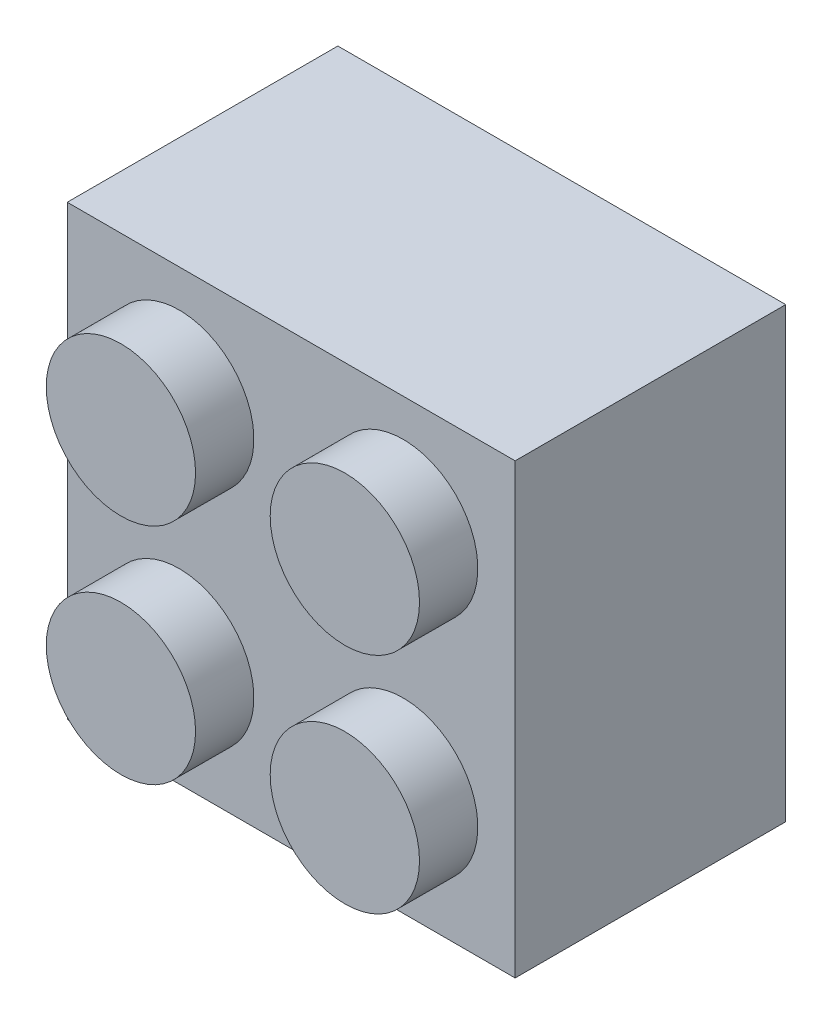
ISO-10303-21;
HEADER;
FILE_DESCRIPTION(('STEP AP214'),'2;1');
FILE_NAME('part.step','',(''),(''),'','','');
FILE_SCHEMA(('AUTOMOTIVE_DESIGN { 1 0 10303 214 1 1 1 1 }'));
ENDSEC;
DATA;
#1=APPLICATION_CONTEXT('core data for automotive mechanical design processes');
#2=APPLICATION_PROTOCOL_DEFINITION('international standard','automotive_design',2000,#1);
#3=PRODUCT_CONTEXT('',#1,'mechanical');
#4=PRODUCT('Part','Part','',(#3));
#5=PRODUCT_RELATED_PRODUCT_CATEGORY('part','',(#4));
#6=PRODUCT_DEFINITION_FORMATION('','',#4);
#7=PRODUCT_DEFINITION_CONTEXT('part definition',#1,'design');
#8=PRODUCT_DEFINITION('design','',#6,#7);
#9=PRODUCT_DEFINITION_SHAPE('','',#8);
#10=(LENGTH_UNIT() NAMED_UNIT(*) SI_UNIT(.MILLI.,.METRE.));
#11=(NAMED_UNIT(*) PLANE_ANGLE_UNIT() SI_UNIT($,.RADIAN.));
#12=(NAMED_UNIT(*) SI_UNIT($,.STERADIAN.) SOLID_ANGLE_UNIT());
#13=UNCERTAINTY_MEASURE_WITH_UNIT(LENGTH_MEASURE(1.E-05),#10,'distance_accuracy_value','');
#14=(GEOMETRIC_REPRESENTATION_CONTEXT(3) GLOBAL_UNCERTAINTY_ASSIGNED_CONTEXT((#13)) GLOBAL_UNIT_ASSIGNED_CONTEXT((#10,
#11,#12)) REPRESENTATION_CONTEXT('',''));
#15=CARTESIAN_POINT('',(0.,0.,0.));
#16=DIRECTION('',(0.,0.,1.));
#17=DIRECTION('',(1.,0.,0.));
#18=AXIS2_PLACEMENT_3D('',#15,#16,#17);
#19=CARTESIAN_POINT('',(0.,0.,0.));
#20=DIRECTION('',(0.,0.,-1.));
#21=DIRECTION('',(-1.,0.,0.));
#22=AXIS2_PLACEMENT_3D('',#19,#20,#21);
#23=PLANE('',#22);
#24=DIRECTION('',(0.,-1.,0.));
#25=VECTOR('',#24,1.);
#26=CARTESIAN_POINT('',(-48.,-48.,0.));
#27=LINE('',#26,#25);
#28=CARTESIAN_POINT('',(-48.,48.,0.));
#29=VERTEX_POINT('',#28);
#30=CARTESIAN_POINT('',(-48.,-48.,0.));
#31=VERTEX_POINT('',#30);
#32=EDGE_CURVE('E188',#29,#31,#27,.T.);
#33=ORIENTED_EDGE('',*,*,#32,.F.);
#34=DIRECTION('',(-1.,0.,0.));
#35=VECTOR('',#34,1.);
#36=CARTESIAN_POINT('',(-48.,48.,0.));
#37=LINE('',#36,#35);
#38=CARTESIAN_POINT('',(48.,48.,0.));
#39=VERTEX_POINT('',#38);
#40=EDGE_CURVE('E67',#39,#29,#37,.T.);
#41=ORIENTED_EDGE('',*,*,#40,.F.);
#42=DIRECTION('',(0.,1.,0.));
#43=VECTOR('',#42,1.);
#44=CARTESIAN_POINT('',(48.,48.,0.));
#45=LINE('',#44,#43);
#46=CARTESIAN_POINT('',(48.,-48.,0.));
#47=VERTEX_POINT('',#46);
#48=EDGE_CURVE('E117',#47,#39,#45,.T.);
#49=ORIENTED_EDGE('',*,*,#48,.F.);
#50=DIRECTION('',(1.,0.,0.));
#51=VECTOR('',#50,1.);
#52=CARTESIAN_POINT('',(48.,-48.,0.));
#53=LINE('',#52,#51);
#54=EDGE_CURVE('E192',#31,#47,#53,.T.);
#55=ORIENTED_EDGE('',*,*,#54,.F.);
#56=EDGE_LOOP('',(#33,#41,#49,#55));
#57=FACE_BOUND('',#56,.T.);
#58=DIRECTION('',(-1.,0.,0.));
#59=VECTOR('',#58,1.);
#60=CARTESIAN_POINT('',(-40.,40.,0.));
#61=LINE('',#60,#59);
#62=CARTESIAN_POINT('',(40.,40.,0.));
#63=VERTEX_POINT('',#62);
#64=CARTESIAN_POINT('',(-40.,40.,0.));
#65=VERTEX_POINT('',#64);
#66=EDGE_CURVE('E151',#63,#65,#61,.T.);
#67=ORIENTED_EDGE('',*,*,#66,.T.);
#68=DIRECTION('',(0.,-1.,0.));
#69=VECTOR('',#68,1.);
#70=CARTESIAN_POINT('',(-40.,-40.,0.));
#71=LINE('',#70,#69);
#72=CARTESIAN_POINT('',(-40.,-40.,0.));
#73=VERTEX_POINT('',#72);
#74=EDGE_CURVE('E59',#65,#73,#71,.T.);
#75=ORIENTED_EDGE('',*,*,#74,.T.);
#76=DIRECTION('',(1.,0.,0.));
#77=VECTOR('',#76,1.);
#78=CARTESIAN_POINT('',(40.,-40.,0.));
#79=LINE('',#78,#77);
#80=CARTESIAN_POINT('',(40.,-40.,0.));
#81=VERTEX_POINT('',#80);
#82=EDGE_CURVE('E166',#73,#81,#79,.T.);
#83=ORIENTED_EDGE('',*,*,#82,.T.);
#84=DIRECTION('',(0.,1.,0.));
#85=VECTOR('',#84,1.);
#86=CARTESIAN_POINT('',(40.,40.,0.));
#87=LINE('',#86,#85);
#88=EDGE_CURVE('E170',#81,#63,#87,.T.);
#89=ORIENTED_EDGE('',*,*,#88,.T.);
#90=EDGE_LOOP('',(#67,#75,#83,#89));
#91=FACE_BOUND('',#90,.T.);
#92=ADVANCED_FACE('F43',(#57,#91),#23,.T.);
#93=CARTESIAN_POINT('',(-48.,-48.,48.));
#94=DIRECTION('',(1.,0.,0.));
#95=DIRECTION('',(0.,1.,0.));
#96=AXIS2_PLACEMENT_3D('',#93,#94,#95);
#97=PLANE('',#96);
#98=ORIENTED_EDGE('',*,*,#32,.T.);
#99=DIRECTION('',(0.,0.,-1.));
#100=VECTOR('',#99,1.);
#101=CARTESIAN_POINT('',(-48.,-48.,48.));
#102=LINE('',#101,#100);
#103=CARTESIAN_POINT('',(-48.,-48.,58.));
#104=VERTEX_POINT('',#103);
#105=EDGE_CURVE('E203',#104,#31,#102,.T.);
#106=ORIENTED_EDGE('',*,*,#105,.F.);
#107=DIRECTION('',(0.,1.,0.));
#108=VECTOR('',#107,1.);
#109=CARTESIAN_POINT('',(-48.,48.,58.));
#110=LINE('',#109,#108);
#111=CARTESIAN_POINT('',(-48.,48.,58.));
#112=VERTEX_POINT('',#111);
#113=EDGE_CURVE('E144',#104,#112,#110,.T.);
#114=ORIENTED_EDGE('',*,*,#113,.T.);
#115=DIRECTION('',(0.,0.,-1.));
#116=VECTOR('',#115,1.);
#117=CARTESIAN_POINT('',(-48.,48.,48.));
#118=LINE('',#117,#116);
#119=EDGE_CURVE('E121',#112,#29,#118,.T.);
#120=ORIENTED_EDGE('',*,*,#119,.T.);
#121=EDGE_LOOP('',(#98,#106,#114,#120));
#122=FACE_BOUND('',#121,.T.);
#123=ADVANCED_FACE('F246',(#122),#97,.F.);
#124=CARTESIAN_POINT('',(48.,-48.,48.));
#125=DIRECTION('',(0.,1.,0.));
#126=DIRECTION('',(-1.,0.,0.));
#127=AXIS2_PLACEMENT_3D('',#124,#125,#126);
#128=PLANE('',#127);
#129=ORIENTED_EDGE('',*,*,#54,.T.);
#130=DIRECTION('',(0.,0.,-1.));
#131=VECTOR('',#130,1.);
#132=CARTESIAN_POINT('',(48.,-48.,48.));
#133=LINE('',#132,#131);
#134=CARTESIAN_POINT('',(48.,-48.,58.));
#135=VERTEX_POINT('',#134);
#136=EDGE_CURVE('E120',#135,#47,#133,.T.);
#137=ORIENTED_EDGE('',*,*,#136,.F.);
#138=DIRECTION('',(-1.,0.,0.));
#139=VECTOR('',#138,1.);
#140=CARTESIAN_POINT('',(-48.,-48.,58.));
#141=LINE('',#140,#139);
#142=EDGE_CURVE('E131',#135,#104,#141,.T.);
#143=ORIENTED_EDGE('',*,*,#142,.T.);
#144=ORIENTED_EDGE('',*,*,#105,.T.);
#145=EDGE_LOOP('',(#129,#137,#143,#144));
#146=FACE_BOUND('',#145,.T.);
#147=ADVANCED_FACE('F252',(#146),#128,.F.);
#148=CARTESIAN_POINT('',(48.,48.,48.));
#149=DIRECTION('',(-1.,0.,0.));
#150=DIRECTION('',(0.,-1.,0.));
#151=AXIS2_PLACEMENT_3D('',#148,#149,#150);
#152=PLANE('',#151);
#153=ORIENTED_EDGE('',*,*,#48,.T.);
#154=DIRECTION('',(0.,0.,-1.));
#155=VECTOR('',#154,1.);
#156=CARTESIAN_POINT('',(48.,48.,48.));
#157=LINE('',#156,#155);
#158=CARTESIAN_POINT('',(48.,48.,58.));
#159=VERTEX_POINT('',#158);
#160=EDGE_CURVE('E111',#159,#39,#157,.T.);
#161=ORIENTED_EDGE('',*,*,#160,.F.);
#162=DIRECTION('',(0.,-1.,0.));
#163=VECTOR('',#162,1.);
#164=CARTESIAN_POINT('',(48.,48.,58.));
#165=LINE('',#164,#163);
#166=EDGE_CURVE('E115',#159,#135,#165,.T.);
#167=ORIENTED_EDGE('',*,*,#166,.T.);
#168=ORIENTED_EDGE('',*,*,#136,.T.);
#169=EDGE_LOOP('',(#153,#161,#167,#168));
#170=FACE_BOUND('',#169,.T.);
#171=ADVANCED_FACE('F113',(#170),#152,.F.);
#172=CARTESIAN_POINT('',(-48.,48.,48.));
#173=DIRECTION('',(0.,-1.,0.));
#174=DIRECTION('',(1.,0.,0.));
#175=AXIS2_PLACEMENT_3D('',#172,#173,#174);
#176=PLANE('',#175);
#177=ORIENTED_EDGE('',*,*,#40,.T.);
#178=ORIENTED_EDGE('',*,*,#119,.F.);
#179=DIRECTION('',(1.,0.,0.));
#180=VECTOR('',#179,1.);
#181=CARTESIAN_POINT('',(-48.,48.,58.));
#182=LINE('',#181,#180);
#183=EDGE_CURVE('E128',#112,#159,#182,.T.);
#184=ORIENTED_EDGE('',*,*,#183,.T.);
#185=ORIENTED_EDGE('',*,*,#160,.T.);
#186=EDGE_LOOP('',(#177,#178,#184,#185));
#187=FACE_BOUND('',#186,.T.);
#188=ADVANCED_FACE('F134',(#187),#176,.F.);
#189=CARTESIAN_POINT('',(-40.,-40.,48.));
#190=DIRECTION('',(1.,0.,0.));
#191=DIRECTION('',(0.,0.,-1.));
#192=AXIS2_PLACEMENT_3D('',#189,#190,#191);
#193=PLANE('',#192);
#194=ORIENTED_EDGE('',*,*,#74,.F.);
#195=DIRECTION('',(0.,0.,-1.));
#196=VECTOR('',#195,1.);
#197=CARTESIAN_POINT('',(-40.,40.,48.));
#198=LINE('',#197,#196);
#199=CARTESIAN_POINT('',(-40.,40.,48.));
#200=VERTEX_POINT('',#199);
#201=EDGE_CURVE('E163',#200,#65,#198,.T.);
#202=ORIENTED_EDGE('',*,*,#201,.F.);
#203=DIRECTION('',(0.,-1.,0.));
#204=VECTOR('',#203,1.);
#205=CARTESIAN_POINT('',(-40.,-40.,48.));
#206=LINE('',#205,#204);
#207=CARTESIAN_POINT('',(-40.,-40.,48.));
#208=VERTEX_POINT('',#207);
#209=EDGE_CURVE('E146',#200,#208,#206,.T.);
#210=ORIENTED_EDGE('',*,*,#209,.T.);
#211=DIRECTION('',(0.,0.,-1.));
#212=VECTOR('',#211,1.);
#213=CARTESIAN_POINT('',(-40.,-40.,48.));
#214=LINE('',#213,#212);
#215=EDGE_CURVE('E185',#208,#73,#214,.T.);
#216=ORIENTED_EDGE('',*,*,#215,.T.);
#217=EDGE_LOOP('',(#194,#202,#210,#216));
#218=FACE_BOUND('',#217,.T.);
#219=ADVANCED_FACE('F258',(#218),#193,.T.);
#220=CARTESIAN_POINT('',(40.,-40.,48.));
#221=DIRECTION('',(0.,1.,0.));
#222=DIRECTION('',(0.,0.,1.));
#223=AXIS2_PLACEMENT_3D('',#220,#221,#222);
#224=PLANE('',#223);
#225=ORIENTED_EDGE('',*,*,#82,.F.);
#226=ORIENTED_EDGE('',*,*,#215,.F.);
#227=DIRECTION('',(1.,0.,0.));
#228=VECTOR('',#227,1.);
#229=CARTESIAN_POINT('',(40.,-40.,48.));
#230=LINE('',#229,#228);
#231=CARTESIAN_POINT('',(40.,-40.,48.));
#232=VERTEX_POINT('',#231);
#233=EDGE_CURVE('E150',#208,#232,#230,.T.);
#234=ORIENTED_EDGE('',*,*,#233,.T.);
#235=DIRECTION('',(0.,0.,-1.));
#236=VECTOR('',#235,1.);
#237=CARTESIAN_POINT('',(40.,-40.,48.));
#238=LINE('',#237,#236);
#239=EDGE_CURVE('E182',#232,#81,#238,.T.);
#240=ORIENTED_EDGE('',*,*,#239,.T.);
#241=EDGE_LOOP('',(#225,#226,#234,#240));
#242=FACE_BOUND('',#241,.T.);
#243=ADVANCED_FACE('F472',(#242),#224,.T.);
#244=CARTESIAN_POINT('',(40.,40.,48.));
#245=DIRECTION('',(-1.,0.,0.));
#246=DIRECTION('',(0.,0.,1.));
#247=AXIS2_PLACEMENT_3D('',#244,#245,#246);
#248=PLANE('',#247);
#249=ORIENTED_EDGE('',*,*,#88,.F.);
#250=ORIENTED_EDGE('',*,*,#239,.F.);
#251=DIRECTION('',(0.,1.,0.));
#252=VECTOR('',#251,1.);
#253=CARTESIAN_POINT('',(40.,40.,48.));
#254=LINE('',#253,#252);
#255=CARTESIAN_POINT('',(40.,40.,48.));
#256=VERTEX_POINT('',#255);
#257=EDGE_CURVE('E155',#232,#256,#254,.T.);
#258=ORIENTED_EDGE('',*,*,#257,.T.);
#259=DIRECTION('',(0.,0.,-1.));
#260=VECTOR('',#259,1.);
#261=CARTESIAN_POINT('',(40.,40.,48.));
#262=LINE('',#261,#260);
#263=EDGE_CURVE('E179',#256,#63,#262,.T.);
#264=ORIENTED_EDGE('',*,*,#263,.T.);
#265=EDGE_LOOP('',(#249,#250,#258,#264));
#266=FACE_BOUND('',#265,.T.);
#267=ADVANCED_FACE('F464',(#266),#248,.T.);
#268=CARTESIAN_POINT('',(-40.,40.,48.));
#269=DIRECTION('',(0.,-1.,0.));
#270=DIRECTION('',(0.,0.,-1.));
#271=AXIS2_PLACEMENT_3D('',#268,#269,#270);
#272=PLANE('',#271);
#273=ORIENTED_EDGE('',*,*,#66,.F.);
#274=ORIENTED_EDGE('',*,*,#263,.F.);
#275=DIRECTION('',(-1.,0.,0.));
#276=VECTOR('',#275,1.);
#277=CARTESIAN_POINT('',(-40.,40.,48.));
#278=LINE('',#277,#276);
#279=EDGE_CURVE('E159',#256,#200,#278,.T.);
#280=ORIENTED_EDGE('',*,*,#279,.T.);
#281=ORIENTED_EDGE('',*,*,#201,.T.);
#282=EDGE_LOOP('',(#273,#274,#280,#281));
#283=FACE_BOUND('',#282,.T.);
#284=ADVANCED_FACE('F243',(#283),#272,.T.);
#285=CARTESIAN_POINT('',(0.,0.,48.));
#286=DIRECTION('',(0.,0.,1.));
#287=DIRECTION('',(1.,0.,0.));
#288=AXIS2_PLACEMENT_3D('',#285,#286,#287);
#289=PLANE('',#288);
#290=CARTESIAN_POINT('',(0.,0.,48.));
#291=DIRECTION('',(0.,0.,1.));
#292=DIRECTION('',(1.,0.,0.));
#293=AXIS2_PLACEMENT_3D('',#290,#291,#292);
#294=CIRCLE('',#293,22.6994558492444);
#295=CARTESIAN_POINT('',(22.6994558492444,0.,48.));
#296=VERTEX_POINT('',#295);
#297=EDGE_CURVE('E12',#296,#296,#294,.T.);
#298=ORIENTED_EDGE('',*,*,#297,.T.);
#299=EDGE_LOOP('',(#298));
#300=FACE_BOUND('',#299,.T.);
#301=ORIENTED_EDGE('',*,*,#209,.F.);
#302=ORIENTED_EDGE('',*,*,#279,.F.);
#303=ORIENTED_EDGE('',*,*,#257,.F.);
#304=ORIENTED_EDGE('',*,*,#233,.F.);
#305=EDGE_LOOP('',(#301,#302,#303,#304));
#306=FACE_BOUND('',#305,.T.);
#307=ADVANCED_FACE('F232',(#300,#306),#289,.F.);
#308=CARTESIAN_POINT('',(0.,0.,58.));
#309=DIRECTION('',(0.,0.,-1.));
#310=DIRECTION('',(-1.,0.,0.));
#311=AXIS2_PLACEMENT_3D('',#308,#309,#310);
#312=PLANE('',#311);
#313=CARTESIAN_POINT('',(-24.,-24.,58.));
#314=DIRECTION('',(0.,0.,-1.));
#315=DIRECTION('',(-1.,0.,0.));
#316=AXIS2_PLACEMENT_3D('',#313,#314,#315);
#317=CIRCLE('',#316,16.);
#318=CARTESIAN_POINT('',(-40.,-24.,58.));
#319=VERTEX_POINT('',#318);
#320=EDGE_CURVE('E219',#319,#319,#317,.F.);
#321=ORIENTED_EDGE('',*,*,#320,.F.);
#322=EDGE_LOOP('',(#321));
#323=FACE_BOUND('',#322,.T.);
#324=CARTESIAN_POINT('',(24.,-24.,58.));
#325=DIRECTION('',(0.,0.,-1.));
#326=DIRECTION('',(-1.,0.,0.));
#327=AXIS2_PLACEMENT_3D('',#324,#325,#326);
#328=CIRCLE('',#327,16.);
#329=CARTESIAN_POINT('',(8.00000000000001,-24.,58.));
#330=VERTEX_POINT('',#329);
#331=EDGE_CURVE('E215',#330,#330,#328,.F.);
#332=ORIENTED_EDGE('',*,*,#331,.F.);
#333=EDGE_LOOP('',(#332));
#334=FACE_BOUND('',#333,.T.);
#335=CARTESIAN_POINT('',(24.,24.,58.));
#336=DIRECTION('',(0.,0.,-1.));
#337=DIRECTION('',(-1.,0.,0.));
#338=AXIS2_PLACEMENT_3D('',#335,#336,#337);
#339=CIRCLE('',#338,16.);
#340=CARTESIAN_POINT('',(8.,24.,58.));
#341=VERTEX_POINT('',#340);
#342=EDGE_CURVE('E211',#341,#341,#339,.F.);
#343=ORIENTED_EDGE('',*,*,#342,.F.);
#344=EDGE_LOOP('',(#343));
#345=FACE_BOUND('',#344,.T.);
#346=CARTESIAN_POINT('',(-24.,24.,58.));
#347=DIRECTION('',(0.,0.,-1.));
#348=DIRECTION('',(-1.,0.,0.));
#349=AXIS2_PLACEMENT_3D('',#346,#347,#348);
#350=CIRCLE('',#349,16.);
#351=CARTESIAN_POINT('',(-40.,24.,58.));
#352=VERTEX_POINT('',#351);
#353=EDGE_CURVE('E207',#352,#352,#350,.F.);
#354=ORIENTED_EDGE('',*,*,#353,.F.);
#355=EDGE_LOOP('',(#354));
#356=FACE_BOUND('',#355,.T.);
#357=ORIENTED_EDGE('',*,*,#142,.F.);
#358=ORIENTED_EDGE('',*,*,#166,.F.);
#359=ORIENTED_EDGE('',*,*,#183,.F.);
#360=ORIENTED_EDGE('',*,*,#113,.F.);
#361=EDGE_LOOP('',(#357,#358,#359,#360));
#362=FACE_BOUND('',#361,.T.);
#363=ADVANCED_FACE('F126',(#323,#334,#345,#356,#362),#312,.F.);
#364=CARTESIAN_POINT('',(-24.,24.,70.5));
#365=DIRECTION('',(0.,0.,-1.));
#366=DIRECTION('',(-1.,0.,0.));
#367=AXIS2_PLACEMENT_3D('',#364,#365,#366);
#368=CYLINDRICAL_SURFACE('',#367,16.);
#369=CARTESIAN_POINT('',(-24.,24.,70.5));
#370=DIRECTION('',(0.,0.,1.));
#371=DIRECTION('',(1.,0.,0.));
#372=AXIS2_PLACEMENT_3D('',#369,#370,#371);
#373=CIRCLE('',#372,16.);
#374=CARTESIAN_POINT('',(-7.99999999999999,24.,70.5));
#375=VERTEX_POINT('',#374);
#376=EDGE_CURVE('E136',#375,#375,#373,.T.);
#377=ORIENTED_EDGE('',*,*,#376,.F.);
#378=EDGE_LOOP('',(#377));
#379=FACE_BOUND('',#378,.T.);
#380=ORIENTED_EDGE('',*,*,#353,.T.);
#381=EDGE_LOOP('',(#380));
#382=FACE_BOUND('',#381,.T.);
#383=ADVANCED_FACE('F326',(#379,#382),#368,.T.);
#384=CARTESIAN_POINT('',(-24.,24.,70.5));
#385=DIRECTION('',(0.,0.,1.));
#386=DIRECTION('',(1.,0.,0.));
#387=AXIS2_PLACEMENT_3D('',#384,#385,#386);
#388=PLANE('',#387);
#389=ORIENTED_EDGE('',*,*,#376,.T.);
#390=EDGE_LOOP('',(#389));
#391=FACE_BOUND('',#390,.T.);
#392=ADVANCED_FACE('F322',(#391),#388,.T.);
#393=CARTESIAN_POINT('',(24.,24.,70.5));
#394=DIRECTION('',(0.,0.,-1.));
#395=DIRECTION('',(-1.,0.,0.));
#396=AXIS2_PLACEMENT_3D('',#393,#394,#395);
#397=CYLINDRICAL_SURFACE('',#396,16.);
#398=CARTESIAN_POINT('',(24.,24.,70.5));
#399=DIRECTION('',(0.,0.,1.));
#400=DIRECTION('',(1.,0.,0.));
#401=AXIS2_PLACEMENT_3D('',#398,#399,#400);
#402=CIRCLE('',#401,16.);
#403=CARTESIAN_POINT('',(40.,24.,70.5));
#404=VERTEX_POINT('',#403);
#405=EDGE_CURVE('E140',#404,#404,#402,.T.);
#406=ORIENTED_EDGE('',*,*,#405,.F.);
#407=EDGE_LOOP('',(#406));
#408=FACE_BOUND('',#407,.T.);
#409=ORIENTED_EDGE('',*,*,#342,.T.);
#410=EDGE_LOOP('',(#409));
#411=FACE_BOUND('',#410,.T.);
#412=ADVANCED_FACE('F318',(#408,#411),#397,.T.);
#413=CARTESIAN_POINT('',(24.,24.,70.5));
#414=DIRECTION('',(0.,0.,1.));
#415=DIRECTION('',(1.,0.,0.));
#416=AXIS2_PLACEMENT_3D('',#413,#414,#415);
#417=PLANE('',#416);
#418=ORIENTED_EDGE('',*,*,#405,.T.);
#419=EDGE_LOOP('',(#418));
#420=FACE_BOUND('',#419,.T.);
#421=ADVANCED_FACE('F314',(#420),#417,.T.);
#422=CARTESIAN_POINT('',(24.,-24.,70.5));
#423=DIRECTION('',(0.,0.,-1.));
#424=DIRECTION('',(-1.,0.,0.));
#425=AXIS2_PLACEMENT_3D('',#422,#423,#424);
#426=CYLINDRICAL_SURFACE('',#425,16.);
#427=CARTESIAN_POINT('',(24.,-24.,70.5));
#428=DIRECTION('',(0.,0.,1.));
#429=DIRECTION('',(1.,0.,0.));
#430=AXIS2_PLACEMENT_3D('',#427,#428,#429);
#431=CIRCLE('',#430,16.);
#432=CARTESIAN_POINT('',(40.,-24.,70.5));
#433=VERTEX_POINT('',#432);
#434=EDGE_CURVE('E274',#433,#433,#431,.T.);
#435=ORIENTED_EDGE('',*,*,#434,.F.);
#436=EDGE_LOOP('',(#435));
#437=FACE_BOUND('',#436,.T.);
#438=ORIENTED_EDGE('',*,*,#331,.T.);
#439=EDGE_LOOP('',(#438));
#440=FACE_BOUND('',#439,.T.);
#441=ADVANCED_FACE('F310',(#437,#440),#426,.T.);
#442=CARTESIAN_POINT('',(24.,-24.,70.5));
#443=DIRECTION('',(0.,0.,1.));
#444=DIRECTION('',(1.,0.,0.));
#445=AXIS2_PLACEMENT_3D('',#442,#443,#444);
#446=PLANE('',#445);
#447=ORIENTED_EDGE('',*,*,#434,.T.);
#448=EDGE_LOOP('',(#447));
#449=FACE_BOUND('',#448,.T.);
#450=ADVANCED_FACE('F306',(#449),#446,.T.);
#451=CARTESIAN_POINT('',(-24.,-24.,70.5));
#452=DIRECTION('',(0.,0.,-1.));
#453=DIRECTION('',(-1.,0.,0.));
#454=AXIS2_PLACEMENT_3D('',#451,#452,#453);
#455=CYLINDRICAL_SURFACE('',#454,16.);
#456=CARTESIAN_POINT('',(-24.,-24.,70.5));
#457=DIRECTION('',(0.,0.,1.));
#458=DIRECTION('',(1.,0.,0.));
#459=AXIS2_PLACEMENT_3D('',#456,#457,#458);
#460=CIRCLE('',#459,16.);
#461=CARTESIAN_POINT('',(-7.99999999999999,-24.,70.5));
#462=VERTEX_POINT('',#461);
#463=EDGE_CURVE('E278',#462,#462,#460,.T.);
#464=ORIENTED_EDGE('',*,*,#463,.F.);
#465=EDGE_LOOP('',(#464));
#466=FACE_BOUND('',#465,.T.);
#467=ORIENTED_EDGE('',*,*,#320,.T.);
#468=EDGE_LOOP('',(#467));
#469=FACE_BOUND('',#468,.T.);
#470=ADVANCED_FACE('F300',(#466,#469),#455,.T.);
#471=CARTESIAN_POINT('',(-24.,-24.,70.5));
#472=DIRECTION('',(0.,0.,1.));
#473=DIRECTION('',(1.,0.,0.));
#474=AXIS2_PLACEMENT_3D('',#471,#472,#473);
#475=PLANE('',#474);
#476=ORIENTED_EDGE('',*,*,#463,.T.);
#477=EDGE_LOOP('',(#476));
#478=FACE_BOUND('',#477,.T.);
#479=ADVANCED_FACE('F295',(#478),#475,.T.);
#480=CARTESIAN_POINT('',(0.,0.,100.325901807805));
#481=DIRECTION('',(0.,0.,-1.));
#482=DIRECTION('',(-1.,0.,0.));
#483=AXIS2_PLACEMENT_3D('',#480,#481,#482);
#484=CYLINDRICAL_SURFACE('',#483,11.5);
#485=CARTESIAN_POINT('',(0.,0.,0.));
#486=DIRECTION('',(0.,0.,-1.));
#487=DIRECTION('',(-1.,0.,0.));
#488=AXIS2_PLACEMENT_3D('',#485,#486,#487);
#489=CIRCLE('',#488,11.5);
#490=CARTESIAN_POINT('',(-11.5,0.,0.));
#491=VERTEX_POINT('',#490);
#492=EDGE_CURVE('E283',#491,#491,#489,.T.);
#493=ORIENTED_EDGE('',*,*,#492,.T.);
#494=EDGE_LOOP('',(#493));
#495=FACE_BOUND('',#494,.T.);
#496=CARTESIAN_POINT('',(0.,0.,48.));
#497=DIRECTION('',(0.,0.,1.));
#498=DIRECTION('',(1.,0.,0.));
#499=AXIS2_PLACEMENT_3D('',#496,#497,#498);
#500=CIRCLE('',#499,11.5);
#501=CARTESIAN_POINT('',(11.5,0.,48.));
#502=VERTEX_POINT('',#501);
#503=EDGE_CURVE('E52',#502,#502,#500,.T.);
#504=ORIENTED_EDGE('',*,*,#503,.T.);
#505=EDGE_LOOP('',(#504));
#506=FACE_BOUND('',#505,.T.);
#507=ADVANCED_FACE('F226',(#495,#506),#484,.F.);
#508=CARTESIAN_POINT('',(0.,0.,0.));
#509=DIRECTION('',(0.,0.,-1.));
#510=DIRECTION('',(-1.,0.,0.));
#511=AXIS2_PLACEMENT_3D('',#508,#509,#510);
#512=PLANE('',#511);
#513=ORIENTED_EDGE('',*,*,#492,.F.);
#514=EDGE_LOOP('',(#513));
#515=FACE_BOUND('',#514,.T.);
#516=CARTESIAN_POINT('',(0.,0.,0.));
#517=DIRECTION('',(0.,0.,-1.));
#518=DIRECTION('',(-1.,0.,0.));
#519=AXIS2_PLACEMENT_3D('',#516,#517,#518);
#520=CIRCLE('',#519,18.5);
#521=CARTESIAN_POINT('',(-18.5,0.,0.));
#522=VERTEX_POINT('',#521);
#523=EDGE_CURVE('E282',#522,#522,#520,.T.);
#524=ORIENTED_EDGE('',*,*,#523,.T.);
#525=EDGE_LOOP('',(#524));
#526=FACE_BOUND('',#525,.T.);
#527=ADVANCED_FACE('F230',(#515,#526),#512,.T.);
#528=ORIENTED_EDGE('',*,*,#503,.F.);
#529=EDGE_LOOP('',(#528));
#530=FACE_BOUND('',#529,.T.);
#531=ADVANCED_FACE('F228',(#530),#289,.F.);
#532=CARTESIAN_POINT('',(0.,0.,1.73472347597681E-12));
#533=DIRECTION('',(0.,0.,1.));
#534=DIRECTION('',(1.,0.,0.));
#535=AXIS2_PLACEMENT_3D('',#532,#533,#534);
#536=CONICAL_SURFACE('',#535,18.5,0.0872664625997202);
#537=ORIENTED_EDGE('',*,*,#297,.F.);
#538=EDGE_LOOP('',(#537));
#539=FACE_BOUND('',#538,.T.);
#540=ORIENTED_EDGE('',*,*,#523,.F.);
#541=EDGE_LOOP('',(#540));
#542=FACE_BOUND('',#541,.T.);
#543=ADVANCED_FACE('F45',(#539,#542),#536,.T.);
#544=CLOSED_SHELL('',(#92,#123,#147,#171,#188,#219,#243,#267,#284,#307,#363,#383,#392,#412,#421,
#441,#450,#470,#479,#507,#527,#531,#543));
#545=MANIFOLD_SOLID_BREP('B2',#544);
#546=ADVANCED_BREP_SHAPE_REPRESENTATION('',(#18,#545),#14);
#547=SHAPE_DEFINITION_REPRESENTATION(#9,#546);
ENDSEC;
END-ISO-10303-21;
